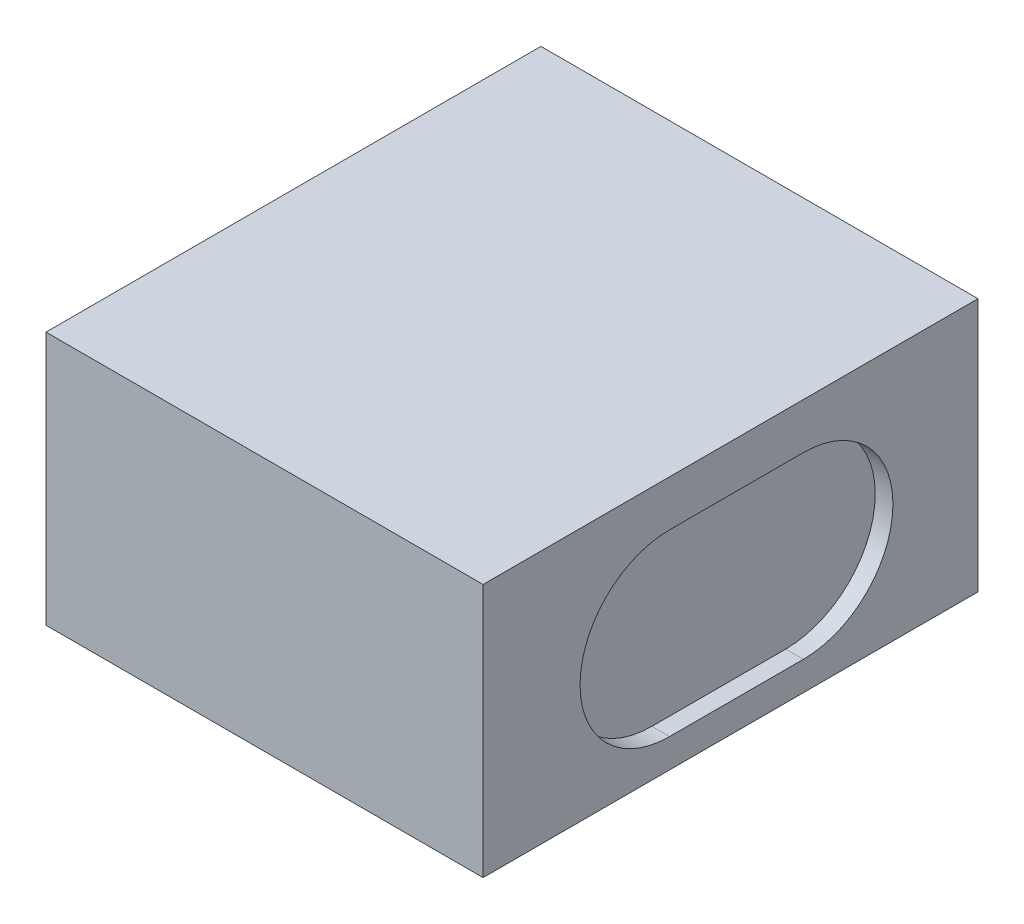
ISO-10303-21;
HEADER;
FILE_DESCRIPTION(('STEP AP214'),'2;1');
FILE_NAME('part.step','',(''),(''),'','','');
FILE_SCHEMA(('AUTOMOTIVE_DESIGN { 1 0 10303 214 1 1 1 1 }'));
ENDSEC;
DATA;
#1=APPLICATION_CONTEXT('core data for automotive mechanical design processes');
#2=APPLICATION_PROTOCOL_DEFINITION('international standard','automotive_design',2000,#1);
#3=PRODUCT_CONTEXT('',#1,'mechanical');
#4=PRODUCT('Part','Part','',(#3));
#5=PRODUCT_RELATED_PRODUCT_CATEGORY('part','',(#4));
#6=PRODUCT_DEFINITION_FORMATION('','',#4);
#7=PRODUCT_DEFINITION_CONTEXT('part definition',#1,'design');
#8=PRODUCT_DEFINITION('design','',#6,#7);
#9=PRODUCT_DEFINITION_SHAPE('','',#8);
#10=(LENGTH_UNIT() NAMED_UNIT(*) SI_UNIT(.MILLI.,.METRE.));
#11=(NAMED_UNIT(*) PLANE_ANGLE_UNIT() SI_UNIT($,.RADIAN.));
#12=(NAMED_UNIT(*) SI_UNIT($,.STERADIAN.) SOLID_ANGLE_UNIT());
#13=UNCERTAINTY_MEASURE_WITH_UNIT(LENGTH_MEASURE(1.E-05),#10,'distance_accuracy_value','');
#14=(GEOMETRIC_REPRESENTATION_CONTEXT(3) GLOBAL_UNCERTAINTY_ASSIGNED_CONTEXT((#13)) GLOBAL_UNIT_ASSIGNED_CONTEXT((#10,
#11,#12)) REPRESENTATION_CONTEXT('',''));
#15=CARTESIAN_POINT('',(0.,0.,0.));
#16=DIRECTION('',(0.,0.,1.));
#17=DIRECTION('',(1.,0.,0.));
#18=AXIS2_PLACEMENT_3D('',#15,#16,#17);
#19=CARTESIAN_POINT('',(0.,3.95,0.));
#20=DIRECTION('',(1.,0.,0.));
#21=DIRECTION('',(0.,0.,-1.));
#22=AXIS2_PLACEMENT_3D('',#19,#20,#21);
#23=PLANE('',#22);
#24=DIRECTION('',(0.,0.,1.));
#25=VECTOR('',#24,1.);
#26=CARTESIAN_POINT('',(0.,0.,0.));
#27=LINE('',#26,#25);
#28=CARTESIAN_POINT('',(0.,0.,-7.7));
#29=VERTEX_POINT('',#28);
#30=CARTESIAN_POINT('',(0.,0.,0.));
#31=VERTEX_POINT('',#30);
#32=EDGE_CURVE('E139',#29,#31,#27,.T.);
#33=ORIENTED_EDGE('',*,*,#32,.T.);
#34=DIRECTION('',(0.,-1.,0.));
#35=VECTOR('',#34,1.);
#36=CARTESIAN_POINT('',(0.,3.95,0.));
#37=LINE('',#36,#35);
#38=CARTESIAN_POINT('',(0.,3.95,0.));
#39=VERTEX_POINT('',#38);
#40=EDGE_CURVE('E11',#39,#31,#37,.T.);
#41=ORIENTED_EDGE('',*,*,#40,.F.);
#42=DIRECTION('',(0.,0.,1.));
#43=VECTOR('',#42,1.);
#44=CARTESIAN_POINT('',(0.,3.95,0.));
#45=LINE('',#44,#43);
#46=CARTESIAN_POINT('',(0.,3.95,-7.7));
#47=VERTEX_POINT('',#46);
#48=EDGE_CURVE('E143',#47,#39,#45,.T.);
#49=ORIENTED_EDGE('',*,*,#48,.F.);
#50=DIRECTION('',(0.,-1.,0.));
#51=VECTOR('',#50,1.);
#52=CARTESIAN_POINT('',(0.,3.95,-7.7));
#53=LINE('',#52,#51);
#54=EDGE_CURVE('E149',#47,#29,#53,.T.);
#55=ORIENTED_EDGE('',*,*,#54,.T.);
#56=EDGE_LOOP('',(#33,#41,#49,#55));
#57=FACE_BOUND('',#56,.T.);
#58=ADVANCED_FACE('F31',(#57),#23,.F.);
#59=CARTESIAN_POINT('',(0.,3.95,0.));
#60=DIRECTION('',(0.,0.,-1.));
#61=DIRECTION('',(-1.,0.,0.));
#62=AXIS2_PLACEMENT_3D('',#59,#60,#61);
#63=PLANE('',#62);
#64=DIRECTION('',(1.,0.,0.));
#65=VECTOR('',#64,1.);
#66=CARTESIAN_POINT('',(0.,0.,0.));
#67=LINE('',#66,#65);
#68=CARTESIAN_POINT('',(6.8,0.,0.));
#69=VERTEX_POINT('',#68);
#70=EDGE_CURVE('E152',#31,#69,#67,.T.);
#71=ORIENTED_EDGE('',*,*,#70,.T.);
#72=DIRECTION('',(0.,-1.,0.));
#73=VECTOR('',#72,1.);
#74=CARTESIAN_POINT('',(6.8,3.95,0.));
#75=LINE('',#74,#73);
#76=CARTESIAN_POINT('',(6.8,3.95,0.));
#77=VERTEX_POINT('',#76);
#78=EDGE_CURVE('E38',#77,#69,#75,.T.);
#79=ORIENTED_EDGE('',*,*,#78,.F.);
#80=DIRECTION('',(1.,0.,0.));
#81=VECTOR('',#80,1.);
#82=CARTESIAN_POINT('',(0.,3.95,0.));
#83=LINE('',#82,#81);
#84=EDGE_CURVE('E82',#39,#77,#83,.T.);
#85=ORIENTED_EDGE('',*,*,#84,.F.);
#86=ORIENTED_EDGE('',*,*,#40,.T.);
#87=EDGE_LOOP('',(#71,#79,#85,#86));
#88=FACE_BOUND('',#87,.T.);
#89=ADVANCED_FACE('F180',(#88),#63,.F.);
#90=CARTESIAN_POINT('',(6.8,3.95,0.));
#91=DIRECTION('',(-1.,0.,0.));
#92=DIRECTION('',(0.,0.,1.));
#93=AXIS2_PLACEMENT_3D('',#90,#91,#92);
#94=PLANE('',#93);
#95=DIRECTION('',(0.,0.,-1.));
#96=VECTOR('',#95,1.);
#97=CARTESIAN_POINT('',(6.8,0.449703577597104,-2.90168251654221));
#98=LINE('',#97,#96);
#99=CARTESIAN_POINT('',(6.8,0.449703577597104,-2.90168251654221));
#100=VERTEX_POINT('',#99);
#101=CARTESIAN_POINT('',(6.8,0.449703577597104,-4.98352638970209));
#102=VERTEX_POINT('',#101);
#103=EDGE_CURVE('E133',#100,#102,#98,.T.);
#104=ORIENTED_EDGE('',*,*,#103,.F.);
#105=CARTESIAN_POINT('',(6.8,1.84259192438753,-2.90168251654221));
#106=DIRECTION('',(1.,0.,0.));
#107=DIRECTION('',(0.,0.,-1.));
#108=AXIS2_PLACEMENT_3D('',#105,#106,#107);
#109=CIRCLE('',#108,1.39288834679043);
#110=CARTESIAN_POINT('',(6.8,3.23548027117796,-2.90168251654221));
#111=VERTEX_POINT('',#110);
#112=EDGE_CURVE('E45',#111,#100,#109,.T.);
#113=ORIENTED_EDGE('',*,*,#112,.F.);
#114=DIRECTION('',(0.,0.,1.));
#115=VECTOR('',#114,1.);
#116=CARTESIAN_POINT('',(6.8,3.23548027117796,-2.90168251654221));
#117=LINE('',#116,#115);
#118=CARTESIAN_POINT('',(6.8,3.23548027117796,-4.98352638970209));
#119=VERTEX_POINT('',#118);
#120=EDGE_CURVE('E124',#119,#111,#117,.T.);
#121=ORIENTED_EDGE('',*,*,#120,.F.);
#122=CARTESIAN_POINT('',(6.8,1.84259192438753,-4.98352638970209));
#123=DIRECTION('',(1.,0.,0.));
#124=DIRECTION('',(0.,0.,-1.));
#125=AXIS2_PLACEMENT_3D('',#122,#123,#124);
#126=CIRCLE('',#125,1.39288834679043);
#127=EDGE_CURVE('E127',#102,#119,#126,.T.);
#128=ORIENTED_EDGE('',*,*,#127,.F.);
#129=EDGE_LOOP('',(#104,#113,#121,#128));
#130=FACE_BOUND('',#129,.T.);
#131=DIRECTION('',(0.,0.,-1.));
#132=VECTOR('',#131,1.);
#133=CARTESIAN_POINT('',(6.8,0.,0.));
#134=LINE('',#133,#132);
#135=CARTESIAN_POINT('',(6.8,0.,-7.7));
#136=VERTEX_POINT('',#135);
#137=EDGE_CURVE('E154',#69,#136,#134,.T.);
#138=ORIENTED_EDGE('',*,*,#137,.T.);
#139=DIRECTION('',(0.,-1.,0.));
#140=VECTOR('',#139,1.);
#141=CARTESIAN_POINT('',(6.8,3.95,-7.7));
#142=LINE('',#141,#140);
#143=CARTESIAN_POINT('',(6.8,3.95,-7.7));
#144=VERTEX_POINT('',#143);
#145=EDGE_CURVE('E158',#144,#136,#142,.T.);
#146=ORIENTED_EDGE('',*,*,#145,.F.);
#147=DIRECTION('',(0.,0.,-1.));
#148=VECTOR('',#147,1.);
#149=CARTESIAN_POINT('',(6.8,3.95,0.));
#150=LINE('',#149,#148);
#151=EDGE_CURVE('E146',#77,#144,#150,.T.);
#152=ORIENTED_EDGE('',*,*,#151,.F.);
#153=ORIENTED_EDGE('',*,*,#78,.T.);
#154=EDGE_LOOP('',(#138,#146,#152,#153));
#155=FACE_BOUND('',#154,.T.);
#156=ADVANCED_FACE('F163',(#130,#155),#94,.F.);
#157=CARTESIAN_POINT('',(0.,3.95,-7.7));
#158=DIRECTION('',(0.,0.,1.));
#159=DIRECTION('',(1.,0.,0.));
#160=AXIS2_PLACEMENT_3D('',#157,#158,#159);
#161=PLANE('',#160);
#162=DIRECTION('',(-1.,0.,0.));
#163=VECTOR('',#162,1.);
#164=CARTESIAN_POINT('',(0.,0.,-7.7));
#165=LINE('',#164,#163);
#166=EDGE_CURVE('E75',#136,#29,#165,.T.);
#167=ORIENTED_EDGE('',*,*,#166,.T.);
#168=ORIENTED_EDGE('',*,*,#54,.F.);
#169=DIRECTION('',(-1.,0.,0.));
#170=VECTOR('',#169,1.);
#171=CARTESIAN_POINT('',(0.,3.95,-7.7));
#172=LINE('',#171,#170);
#173=EDGE_CURVE('E54',#144,#47,#172,.T.);
#174=ORIENTED_EDGE('',*,*,#173,.F.);
#175=ORIENTED_EDGE('',*,*,#145,.T.);
#176=EDGE_LOOP('',(#167,#168,#174,#175));
#177=FACE_BOUND('',#176,.T.);
#178=ADVANCED_FACE('F171',(#177),#161,.F.);
#179=CARTESIAN_POINT('',(0.,3.95,-7.7));
#180=DIRECTION('',(0.,-1.,0.));
#181=DIRECTION('',(0.,0.,-1.));
#182=AXIS2_PLACEMENT_3D('',#179,#180,#181);
#183=PLANE('',#182);
#184=ORIENTED_EDGE('',*,*,#48,.T.);
#185=ORIENTED_EDGE('',*,*,#84,.T.);
#186=ORIENTED_EDGE('',*,*,#151,.T.);
#187=ORIENTED_EDGE('',*,*,#173,.T.);
#188=EDGE_LOOP('',(#184,#185,#186,#187));
#189=FACE_BOUND('',#188,.T.);
#190=ADVANCED_FACE('F173',(#189),#183,.F.);
#191=CARTESIAN_POINT('',(0.,0.,-7.7));
#192=DIRECTION('',(0.,-1.,0.));
#193=DIRECTION('',(0.,0.,-1.));
#194=AXIS2_PLACEMENT_3D('',#191,#192,#193);
#195=PLANE('',#194);
#196=ORIENTED_EDGE('',*,*,#32,.F.);
#197=ORIENTED_EDGE('',*,*,#166,.F.);
#198=ORIENTED_EDGE('',*,*,#137,.F.);
#199=ORIENTED_EDGE('',*,*,#70,.F.);
#200=EDGE_LOOP('',(#196,#197,#198,#199));
#201=FACE_BOUND('',#200,.T.);
#202=ADVANCED_FACE('F167',(#201),#195,.T.);
#203=CARTESIAN_POINT('',(6.52464579912116,1.84259192438753,-2.90168251654221));
#204=DIRECTION('',(1.,0.,0.));
#205=DIRECTION('',(0.,0.,-1.));
#206=AXIS2_PLACEMENT_3D('',#203,#204,#205);
#207=CYLINDRICAL_SURFACE('',#206,1.39288834679043);
#208=ORIENTED_EDGE('',*,*,#112,.T.);
#209=DIRECTION('',(1.,0.,0.));
#210=VECTOR('',#209,1.);
#211=CARTESIAN_POINT('',(6.52464579912116,0.449703577597104,-2.90168251654221));
#212=LINE('',#211,#210);
#213=CARTESIAN_POINT('',(6.52464579912116,0.449703577597104,-2.90168251654221));
#214=VERTEX_POINT('',#213);
#215=EDGE_CURVE('E102',#214,#100,#212,.T.);
#216=ORIENTED_EDGE('',*,*,#215,.F.);
#217=CARTESIAN_POINT('',(6.52464579912116,1.84259192438753,-2.90168251654221));
#218=DIRECTION('',(1.,0.,0.));
#219=DIRECTION('',(0.,0.,-1.));
#220=AXIS2_PLACEMENT_3D('',#217,#218,#219);
#221=CIRCLE('',#220,1.39288834679043);
#222=CARTESIAN_POINT('',(6.52464579912116,3.23548027117796,-2.90168251654221));
#223=VERTEX_POINT('',#222);
#224=EDGE_CURVE('E106',#223,#214,#221,.T.);
#225=ORIENTED_EDGE('',*,*,#224,.F.);
#226=DIRECTION('',(1.,0.,0.));
#227=VECTOR('',#226,1.);
#228=CARTESIAN_POINT('',(6.52464579912116,3.23548027117796,-2.90168251654221));
#229=LINE('',#228,#227);
#230=EDGE_CURVE('E137',#223,#111,#229,.T.);
#231=ORIENTED_EDGE('',*,*,#230,.T.);
#232=EDGE_LOOP('',(#208,#216,#225,#231));
#233=FACE_BOUND('',#232,.T.);
#234=ADVANCED_FACE('F104',(#233),#207,.F.);
#235=CARTESIAN_POINT('',(6.52464579912116,3.23548027117796,-2.90168251654221));
#236=DIRECTION('',(0.,1.,0.));
#237=DIRECTION('',(0.,0.,1.));
#238=AXIS2_PLACEMENT_3D('',#235,#236,#237);
#239=PLANE('',#238);
#240=ORIENTED_EDGE('',*,*,#120,.T.);
#241=ORIENTED_EDGE('',*,*,#230,.F.);
#242=DIRECTION('',(0.,0.,1.));
#243=VECTOR('',#242,1.);
#244=CARTESIAN_POINT('',(6.52464579912116,3.23548027117796,-2.90168251654221));
#245=LINE('',#244,#243);
#246=CARTESIAN_POINT('',(6.52464579912116,3.23548027117796,-4.98352638970209));
#247=VERTEX_POINT('',#246);
#248=EDGE_CURVE('E112',#247,#223,#245,.T.);
#249=ORIENTED_EDGE('',*,*,#248,.F.);
#250=DIRECTION('',(1.,0.,0.));
#251=VECTOR('',#250,1.);
#252=CARTESIAN_POINT('',(6.52464579912116,3.23548027117796,-4.98352638970209));
#253=LINE('',#252,#251);
#254=EDGE_CURVE('E140',#247,#119,#253,.T.);
#255=ORIENTED_EDGE('',*,*,#254,.T.);
#256=EDGE_LOOP('',(#240,#241,#249,#255));
#257=FACE_BOUND('',#256,.T.);
#258=ADVANCED_FACE('F209',(#257),#239,.F.);
#259=CARTESIAN_POINT('',(6.52464579912116,1.84259192438753,-4.98352638970209));
#260=DIRECTION('',(1.,0.,0.));
#261=DIRECTION('',(0.,0.,-1.));
#262=AXIS2_PLACEMENT_3D('',#259,#260,#261);
#263=CYLINDRICAL_SURFACE('',#262,1.39288834679043);
#264=ORIENTED_EDGE('',*,*,#127,.T.);
#265=ORIENTED_EDGE('',*,*,#254,.F.);
#266=CARTESIAN_POINT('',(6.52464579912116,1.84259192438753,-4.98352638970209));
#267=DIRECTION('',(1.,0.,0.));
#268=DIRECTION('',(0.,0.,-1.));
#269=AXIS2_PLACEMENT_3D('',#266,#267,#268);
#270=CIRCLE('',#269,1.39288834679043);
#271=CARTESIAN_POINT('',(6.52464579912116,0.449703577597104,-4.98352638970209));
#272=VERTEX_POINT('',#271);
#273=EDGE_CURVE('E120',#272,#247,#270,.T.);
#274=ORIENTED_EDGE('',*,*,#273,.F.);
#275=DIRECTION('',(1.,0.,0.));
#276=VECTOR('',#275,1.);
#277=CARTESIAN_POINT('',(6.52464579912116,0.449703577597104,-4.98352638970209));
#278=LINE('',#277,#276);
#279=EDGE_CURVE('E111',#272,#102,#278,.T.);
#280=ORIENTED_EDGE('',*,*,#279,.T.);
#281=EDGE_LOOP('',(#264,#265,#274,#280));
#282=FACE_BOUND('',#281,.T.);
#283=ADVANCED_FACE('F218',(#282),#263,.F.);
#284=CARTESIAN_POINT('',(6.52464579912116,0.449703577597104,-2.90168251654221));
#285=DIRECTION('',(0.,-1.,0.));
#286=DIRECTION('',(0.,0.,-1.));
#287=AXIS2_PLACEMENT_3D('',#284,#285,#286);
#288=PLANE('',#287);
#289=ORIENTED_EDGE('',*,*,#103,.T.);
#290=ORIENTED_EDGE('',*,*,#279,.F.);
#291=DIRECTION('',(0.,0.,-1.));
#292=VECTOR('',#291,1.);
#293=CARTESIAN_POINT('',(6.52464579912116,0.449703577597104,-2.90168251654221));
#294=LINE('',#293,#292);
#295=EDGE_CURVE('E115',#214,#272,#294,.T.);
#296=ORIENTED_EDGE('',*,*,#295,.F.);
#297=ORIENTED_EDGE('',*,*,#215,.T.);
#298=EDGE_LOOP('',(#289,#290,#296,#297));
#299=FACE_BOUND('',#298,.T.);
#300=ADVANCED_FACE('F116',(#299),#288,.F.);
#301=CARTESIAN_POINT('',(6.52464579912116,1.84259192438753,-2.90168251654221));
#302=DIRECTION('',(1.,0.,0.));
#303=DIRECTION('',(0.,0.,-1.));
#304=AXIS2_PLACEMENT_3D('',#301,#302,#303);
#305=PLANE('',#304);
#306=ORIENTED_EDGE('',*,*,#224,.T.);
#307=ORIENTED_EDGE('',*,*,#295,.T.);
#308=ORIENTED_EDGE('',*,*,#273,.T.);
#309=ORIENTED_EDGE('',*,*,#248,.T.);
#310=EDGE_LOOP('',(#306,#307,#308,#309));
#311=FACE_BOUND('',#310,.T.);
#312=ADVANCED_FACE('F122',(#311),#305,.T.);
#313=CLOSED_SHELL('',(#58,#89,#156,#178,#190,#202,#234,#258,#283,#300,#312));
#314=MANIFOLD_SOLID_BREP('B2',#313);
#315=ADVANCED_BREP_SHAPE_REPRESENTATION('',(#18,#314),#14);
#316=SHAPE_DEFINITION_REPRESENTATION(#9,#315);
ENDSEC;
END-ISO-10303-21;
